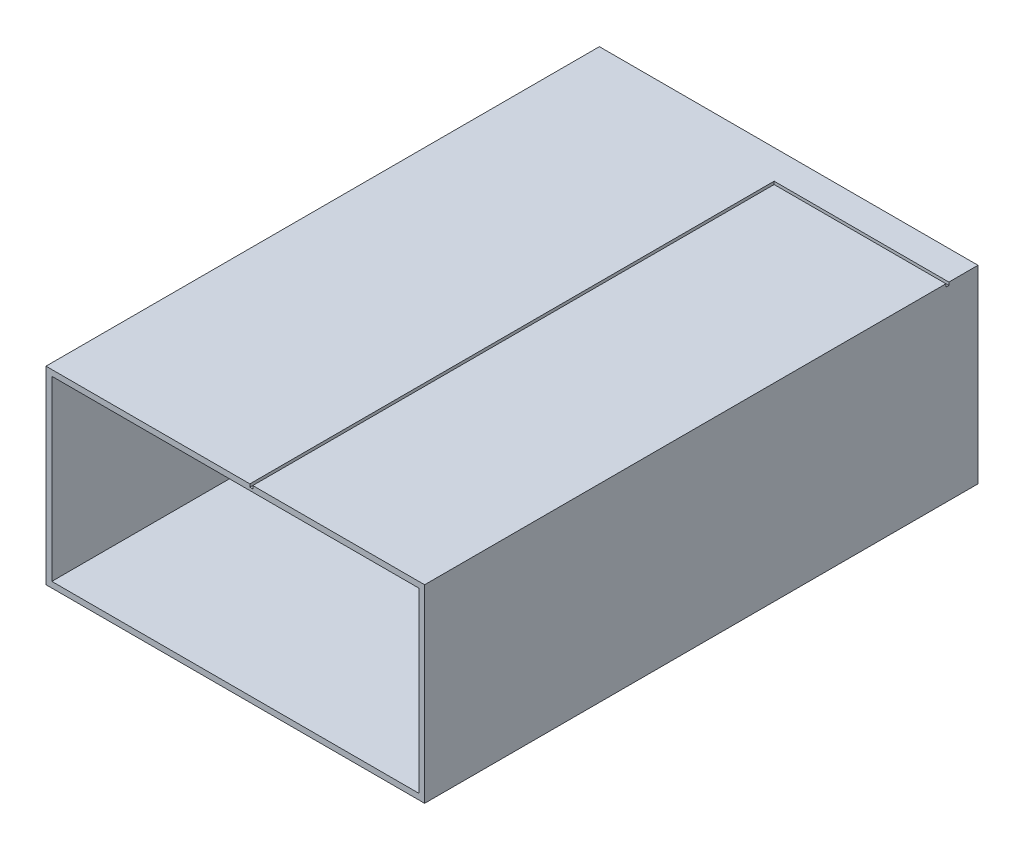
ISO-10303-21;
HEADER;
FILE_DESCRIPTION(('STEP AP214'),'2;1');
FILE_NAME('part.step','',(''),(''),'','','');
FILE_SCHEMA(('AUTOMOTIVE_DESIGN { 1 0 10303 214 1 1 1 1 }'));
ENDSEC;
DATA;
#1=APPLICATION_CONTEXT('core data for automotive mechanical design processes');
#2=APPLICATION_PROTOCOL_DEFINITION('international standard','automotive_design',2000,#1);
#3=PRODUCT_CONTEXT('',#1,'mechanical');
#4=PRODUCT('Part','Part','',(#3));
#5=PRODUCT_RELATED_PRODUCT_CATEGORY('part','',(#4));
#6=PRODUCT_DEFINITION_FORMATION('','',#4);
#7=PRODUCT_DEFINITION_CONTEXT('part definition',#1,'design');
#8=PRODUCT_DEFINITION('design','',#6,#7);
#9=PRODUCT_DEFINITION_SHAPE('','',#8);
#10=(LENGTH_UNIT() NAMED_UNIT(*) SI_UNIT(.MILLI.,.METRE.));
#11=(NAMED_UNIT(*) PLANE_ANGLE_UNIT() SI_UNIT($,.RADIAN.));
#12=(NAMED_UNIT(*) SI_UNIT($,.STERADIAN.) SOLID_ANGLE_UNIT());
#13=UNCERTAINTY_MEASURE_WITH_UNIT(LENGTH_MEASURE(1.E-05),#10,'distance_accuracy_value','');
#14=(GEOMETRIC_REPRESENTATION_CONTEXT(3) GLOBAL_UNCERTAINTY_ASSIGNED_CONTEXT((#13)) GLOBAL_UNIT_ASSIGNED_CONTEXT((#10,
#11,#12)) REPRESENTATION_CONTEXT('',''));
#15=CARTESIAN_POINT('',(0.,0.,0.));
#16=DIRECTION('',(0.,0.,1.));
#17=DIRECTION('',(1.,0.,0.));
#18=AXIS2_PLACEMENT_3D('',#15,#16,#17);
#19=CARTESIAN_POINT('',(-900.,-860.,0.));
#20=DIRECTION('',(-1.,0.,0.));
#21=DIRECTION('',(0.,0.,1.));
#22=AXIS2_PLACEMENT_3D('',#19,#20,#21);
#23=PLANE('',#22);
#24=DIRECTION('',(0.,-1.,0.));
#25=VECTOR('',#24,1.);
#26=CARTESIAN_POINT('',(-900.,-1185.,2000.));
#27=LINE('',#26,#25);
#28=CARTESIAN_POINT('',(-900.,-860.,2000.));
#29=VERTEX_POINT('',#28);
#30=CARTESIAN_POINT('',(-900.,-1510.,2000.));
#31=VERTEX_POINT('',#30);
#32=EDGE_CURVE('E9',#29,#31,#27,.T.);
#33=ORIENTED_EDGE('',*,*,#32,.F.);
#34=DIRECTION('',(0.,0.,1.));
#35=VECTOR('',#34,1.);
#36=CARTESIAN_POINT('',(-900.,-860.,1050.));
#37=LINE('',#36,#35);
#38=CARTESIAN_POINT('',(-900.,-860.,100.));
#39=VERTEX_POINT('',#38);
#40=EDGE_CURVE('E26',#39,#29,#37,.T.);
#41=ORIENTED_EDGE('',*,*,#40,.F.);
#42=DIRECTION('',(0.,-1.,0.));
#43=VECTOR('',#42,1.);
#44=CARTESIAN_POINT('',(-900.,-1185.,100.));
#45=LINE('',#44,#43);
#46=CARTESIAN_POINT('',(-900.,-1510.,100.));
#47=VERTEX_POINT('',#46);
#48=EDGE_CURVE('E259',#39,#47,#45,.T.);
#49=ORIENTED_EDGE('',*,*,#48,.T.);
#50=DIRECTION('',(0.,0.,1.));
#51=VECTOR('',#50,1.);
#52=CARTESIAN_POINT('',(-900.,-1510.,1050.));
#53=LINE('',#52,#51);
#54=EDGE_CURVE('E35',#47,#31,#53,.T.);
#55=ORIENTED_EDGE('',*,*,#54,.T.);
#56=EDGE_LOOP('',(#33,#41,#49,#55));
#57=FACE_BOUND('',#56,.T.);
#58=ADVANCED_FACE('F15',(#57),#23,.T.);
#59=CARTESIAN_POINT('',(-900.,-1510.,0.));
#60=DIRECTION('',(0.,-1.,0.));
#61=DIRECTION('',(0.,0.,-1.));
#62=AXIS2_PLACEMENT_3D('',#59,#60,#61);
#63=PLANE('',#62);
#64=DIRECTION('',(1.,0.,0.));
#65=VECTOR('',#64,1.);
#66=CARTESIAN_POINT('',(-250.,-1510.,2000.));
#67=LINE('',#66,#65);
#68=CARTESIAN_POINT('',(400.,-1510.,2000.));
#69=VERTEX_POINT('',#68);
#70=EDGE_CURVE('E268',#31,#69,#67,.T.);
#71=ORIENTED_EDGE('',*,*,#70,.F.);
#72=ORIENTED_EDGE('',*,*,#54,.F.);
#73=DIRECTION('',(1.,0.,0.));
#74=VECTOR('',#73,1.);
#75=CARTESIAN_POINT('',(-250.,-1510.,100.));
#76=LINE('',#75,#74);
#77=CARTESIAN_POINT('',(400.,-1510.,100.));
#78=VERTEX_POINT('',#77);
#79=EDGE_CURVE('E253',#47,#78,#76,.T.);
#80=ORIENTED_EDGE('',*,*,#79,.T.);
#81=DIRECTION('',(0.,0.,1.));
#82=VECTOR('',#81,1.);
#83=CARTESIAN_POINT('',(400.,-1510.,1050.));
#84=LINE('',#83,#82);
#85=EDGE_CURVE('E158',#78,#69,#84,.T.);
#86=ORIENTED_EDGE('',*,*,#85,.T.);
#87=EDGE_LOOP('',(#71,#72,#80,#86));
#88=FACE_BOUND('',#87,.T.);
#89=ADVANCED_FACE('F287',(#88),#63,.T.);
#90=CARTESIAN_POINT('',(0.,0.,100.));
#91=DIRECTION('',(0.,0.,1.));
#92=DIRECTION('',(1.,0.,0.));
#93=AXIS2_PLACEMENT_3D('',#90,#91,#92);
#94=PLANE('',#93);
#95=DIRECTION('',(0.,1.,0.));
#96=VECTOR('',#95,1.);
#97=CARTESIAN_POINT('',(400.,-1185.,100.));
#98=LINE('',#97,#96);
#99=CARTESIAN_POINT('',(400.,-860.,100.));
#100=VERTEX_POINT('',#99);
#101=EDGE_CURVE('E258',#78,#100,#98,.T.);
#102=ORIENTED_EDGE('',*,*,#101,.F.);
#103=ORIENTED_EDGE('',*,*,#79,.F.);
#104=ORIENTED_EDGE('',*,*,#48,.F.);
#105=DIRECTION('',(-1.,0.,0.));
#106=VECTOR('',#105,1.);
#107=CARTESIAN_POINT('',(-250.000000000001,-860.,100.));
#108=LINE('',#107,#106);
#109=EDGE_CURVE('E254',#100,#39,#108,.T.);
#110=ORIENTED_EDGE('',*,*,#109,.F.);
#111=EDGE_LOOP('',(#102,#103,#104,#110));
#112=FACE_BOUND('',#111,.T.);
#113=ADVANCED_FACE('F289',(#112),#94,.F.);
#114=CARTESIAN_POINT('',(-880.,-880.,2000.));
#115=DIRECTION('',(0.,1.,0.));
#116=DIRECTION('',(0.,0.,1.));
#117=AXIS2_PLACEMENT_3D('',#114,#115,#116);
#118=PLANE('',#117);
#119=DIRECTION('',(-1.,0.,0.));
#120=VECTOR('',#119,1.);
#121=CARTESIAN_POINT('',(-250.,-880.,200.));
#122=LINE('',#121,#120);
#123=CARTESIAN_POINT('',(379.999999999999,-880.,200.));
#124=VERTEX_POINT('',#123);
#125=CARTESIAN_POINT('',(-880.,-880.,200.));
#126=VERTEX_POINT('',#125);
#127=EDGE_CURVE('E245',#124,#126,#122,.T.);
#128=ORIENTED_EDGE('',*,*,#127,.F.);
#129=DIRECTION('',(0.,0.,-1.));
#130=VECTOR('',#129,1.);
#131=CARTESIAN_POINT('',(380.,-880.,1100.));
#132=LINE('',#131,#130);
#133=CARTESIAN_POINT('',(379.999999999999,-880.,2000.));
#134=VERTEX_POINT('',#133);
#135=EDGE_CURVE('E242',#134,#124,#132,.T.);
#136=ORIENTED_EDGE('',*,*,#135,.F.);
#137=DIRECTION('',(-1.,0.,0.));
#138=VECTOR('',#137,1.);
#139=CARTESIAN_POINT('',(-250.,-880.,2000.));
#140=LINE('',#139,#138);
#141=CARTESIAN_POINT('',(-880.,-880.,2000.));
#142=VERTEX_POINT('',#141);
#143=EDGE_CURVE('E229',#134,#142,#140,.T.);
#144=ORIENTED_EDGE('',*,*,#143,.T.);
#145=DIRECTION('',(0.,0.,-1.));
#146=VECTOR('',#145,1.);
#147=CARTESIAN_POINT('',(-880.,-880.,1100.));
#148=LINE('',#147,#146);
#149=EDGE_CURVE('E233',#142,#126,#148,.T.);
#150=ORIENTED_EDGE('',*,*,#149,.T.);
#151=EDGE_LOOP('',(#128,#136,#144,#150));
#152=FACE_BOUND('',#151,.T.);
#153=ADVANCED_FACE('F329',(#152),#118,.F.);
#154=CARTESIAN_POINT('',(-880.,-1490.,2000.));
#155=DIRECTION('',(-1.,0.,0.));
#156=DIRECTION('',(0.,0.,1.));
#157=AXIS2_PLACEMENT_3D('',#154,#155,#156);
#158=PLANE('',#157);
#159=DIRECTION('',(0.,-1.,0.));
#160=VECTOR('',#159,1.);
#161=CARTESIAN_POINT('',(-880.,-1185.,200.));
#162=LINE('',#161,#160);
#163=CARTESIAN_POINT('',(-880.,-1490.,200.));
#164=VERTEX_POINT('',#163);
#165=EDGE_CURVE('E238',#126,#164,#162,.T.);
#166=ORIENTED_EDGE('',*,*,#165,.F.);
#167=ORIENTED_EDGE('',*,*,#149,.F.);
#168=DIRECTION('',(0.,-1.,0.));
#169=VECTOR('',#168,1.);
#170=CARTESIAN_POINT('',(-880.,-1185.,2000.));
#171=LINE('',#170,#169);
#172=CARTESIAN_POINT('',(-880.,-1490.,2000.));
#173=VERTEX_POINT('',#172);
#174=EDGE_CURVE('E217',#142,#173,#171,.T.);
#175=ORIENTED_EDGE('',*,*,#174,.T.);
#176=DIRECTION('',(0.,0.,-1.));
#177=VECTOR('',#176,1.);
#178=CARTESIAN_POINT('',(-880.,-1490.,1100.));
#179=LINE('',#178,#177);
#180=EDGE_CURVE('E212',#173,#164,#179,.T.);
#181=ORIENTED_EDGE('',*,*,#180,.T.);
#182=EDGE_LOOP('',(#166,#167,#175,#181));
#183=FACE_BOUND('',#182,.T.);
#184=ADVANCED_FACE('F322',(#183),#158,.F.);
#185=CARTESIAN_POINT('',(379.999999999999,-880.,2000.));
#186=DIRECTION('',(1.,0.,0.));
#187=DIRECTION('',(0.,0.,-1.));
#188=AXIS2_PLACEMENT_3D('',#185,#186,#187);
#189=PLANE('',#188);
#190=DIRECTION('',(0.,1.,0.));
#191=VECTOR('',#190,1.);
#192=CARTESIAN_POINT('',(379.999999999999,-1185.,200.));
#193=LINE('',#192,#191);
#194=CARTESIAN_POINT('',(379.999999999999,-1490.,200.));
#195=VERTEX_POINT('',#194);
#196=EDGE_CURVE('E225',#195,#124,#193,.T.);
#197=ORIENTED_EDGE('',*,*,#196,.F.);
#198=DIRECTION('',(0.,0.,-1.));
#199=VECTOR('',#198,1.);
#200=CARTESIAN_POINT('',(379.999999999999,-1490.,1100.));
#201=LINE('',#200,#199);
#202=CARTESIAN_POINT('',(379.999999999999,-1490.,2000.));
#203=VERTEX_POINT('',#202);
#204=EDGE_CURVE('E222',#203,#195,#201,.T.);
#205=ORIENTED_EDGE('',*,*,#204,.F.);
#206=DIRECTION('',(0.,1.,0.));
#207=VECTOR('',#206,1.);
#208=CARTESIAN_POINT('',(379.999999999999,-1185.,2000.));
#209=LINE('',#208,#207);
#210=EDGE_CURVE('E150',#203,#134,#209,.T.);
#211=ORIENTED_EDGE('',*,*,#210,.T.);
#212=ORIENTED_EDGE('',*,*,#135,.T.);
#213=EDGE_LOOP('',(#197,#205,#211,#212));
#214=FACE_BOUND('',#213,.T.);
#215=ADVANCED_FACE('F315',(#214),#189,.F.);
#216=CARTESIAN_POINT('',(379.999999999999,-1490.,2000.));
#217=DIRECTION('',(0.,-1.,0.));
#218=DIRECTION('',(0.,0.,-1.));
#219=AXIS2_PLACEMENT_3D('',#216,#217,#218);
#220=PLANE('',#219);
#221=DIRECTION('',(1.,0.,0.));
#222=VECTOR('',#221,1.);
#223=CARTESIAN_POINT('',(-250.,-1490.,200.));
#224=LINE('',#223,#222);
#225=EDGE_CURVE('E218',#164,#195,#224,.T.);
#226=ORIENTED_EDGE('',*,*,#225,.F.);
#227=ORIENTED_EDGE('',*,*,#180,.F.);
#228=DIRECTION('',(1.,0.,0.));
#229=VECTOR('',#228,1.);
#230=CARTESIAN_POINT('',(-250.,-1490.,2000.));
#231=LINE('',#230,#229);
#232=EDGE_CURVE('E213',#173,#203,#231,.T.);
#233=ORIENTED_EDGE('',*,*,#232,.T.);
#234=ORIENTED_EDGE('',*,*,#204,.T.);
#235=EDGE_LOOP('',(#226,#227,#233,#234));
#236=FACE_BOUND('',#235,.T.);
#237=ADVANCED_FACE('F319',(#236),#220,.F.);
#238=CARTESIAN_POINT('',(0.,0.,200.));
#239=DIRECTION('',(0.,0.,1.));
#240=DIRECTION('',(1.,0.,0.));
#241=AXIS2_PLACEMENT_3D('',#238,#239,#240);
#242=PLANE('',#241);
#243=ORIENTED_EDGE('',*,*,#196,.T.);
#244=ORIENTED_EDGE('',*,*,#127,.T.);
#245=ORIENTED_EDGE('',*,*,#165,.T.);
#246=ORIENTED_EDGE('',*,*,#225,.T.);
#247=EDGE_LOOP('',(#243,#244,#245,#246));
#248=FACE_BOUND('',#247,.T.);
#249=CARTESIAN_POINT('',(-250.,-1190.,200.));
#250=DIRECTION('',(0.,0.,1.));
#251=DIRECTION('',(1.,0.,0.));
#252=AXIS2_PLACEMENT_3D('',#249,#250,#251);
#253=CIRCLE('',#252,40.);
#254=CARTESIAN_POINT('',(-210.,-1190.,200.));
#255=VERTEX_POINT('',#254);
#256=EDGE_CURVE('E208',#255,#255,#253,.T.);
#257=ORIENTED_EDGE('',*,*,#256,.F.);
#258=EDGE_LOOP('',(#257));
#259=FACE_BOUND('',#258,.T.);
#260=ADVANCED_FACE('F325',(#248,#259),#242,.T.);
#261=CARTESIAN_POINT('',(-250.,-1190.,190.));
#262=DIRECTION('',(0.,0.,1.));
#263=DIRECTION('',(1.,0.,0.));
#264=AXIS2_PLACEMENT_3D('',#261,#262,#263);
#265=CYLINDRICAL_SURFACE('',#264,40.);
#266=CARTESIAN_POINT('',(-250.,-1190.,180.));
#267=DIRECTION('',(0.,0.,1.));
#268=DIRECTION('',(1.,0.,0.));
#269=AXIS2_PLACEMENT_3D('',#266,#267,#268);
#270=CIRCLE('',#269,40.);
#271=CARTESIAN_POINT('',(-210.,-1190.,180.));
#272=VERTEX_POINT('',#271);
#273=EDGE_CURVE('E204',#272,#272,#270,.T.);
#274=ORIENTED_EDGE('',*,*,#273,.F.);
#275=EDGE_LOOP('',(#274));
#276=FACE_BOUND('',#275,.T.);
#277=ORIENTED_EDGE('',*,*,#256,.T.);
#278=EDGE_LOOP('',(#277));
#279=FACE_BOUND('',#278,.T.);
#280=ADVANCED_FACE('F388',(#276,#279),#265,.F.);
#281=CARTESIAN_POINT('',(0.,0.,180.));
#282=DIRECTION('',(0.,0.,1.));
#283=DIRECTION('',(1.,0.,0.));
#284=AXIS2_PLACEMENT_3D('',#281,#282,#283);
#285=PLANE('',#284);
#286=ORIENTED_EDGE('',*,*,#273,.T.);
#287=EDGE_LOOP('',(#286));
#288=FACE_BOUND('',#287,.T.);
#289=ADVANCED_FACE('F397',(#288),#285,.T.);
#290=CARTESIAN_POINT('',(-190.,-860.,2000.));
#291=DIRECTION('',(-1.,0.,0.));
#292=DIRECTION('',(0.,0.,1.));
#293=AXIS2_PLACEMENT_3D('',#290,#291,#292);
#294=PLANE('',#293);
#295=DIRECTION('',(0.,1.,0.));
#296=VECTOR('',#295,1.);
#297=CARTESIAN_POINT('',(-190.,-865.,210.));
#298=LINE('',#297,#296);
#299=CARTESIAN_POINT('',(-190.,-870.,210.));
#300=VERTEX_POINT('',#299);
#301=CARTESIAN_POINT('',(-190.,-860.,210.));
#302=VERTEX_POINT('',#301);
#303=EDGE_CURVE('E198',#300,#302,#298,.T.);
#304=ORIENTED_EDGE('',*,*,#303,.F.);
#305=DIRECTION('',(0.,0.,-1.));
#306=VECTOR('',#305,1.);
#307=CARTESIAN_POINT('',(-190.,-870.,1105.));
#308=LINE('',#307,#306);
#309=CARTESIAN_POINT('',(-190.,-870.,2000.));
#310=VERTEX_POINT('',#309);
#311=EDGE_CURVE('E192',#310,#300,#308,.T.);
#312=ORIENTED_EDGE('',*,*,#311,.F.);
#313=DIRECTION('',(0.,-1.,0.));
#314=VECTOR('',#313,1.);
#315=CARTESIAN_POINT('',(-190.,-865.,2000.));
#316=LINE('',#315,#314);
#317=CARTESIAN_POINT('',(-190.,-860.,2000.));
#318=VERTEX_POINT('',#317);
#319=EDGE_CURVE('E195',#318,#310,#316,.T.);
#320=ORIENTED_EDGE('',*,*,#319,.F.);
#321=DIRECTION('',(0.,0.,-1.));
#322=VECTOR('',#321,1.);
#323=CARTESIAN_POINT('',(-190.,-860.,1105.));
#324=LINE('',#323,#322);
#325=EDGE_CURVE('E167',#318,#302,#324,.T.);
#326=ORIENTED_EDGE('',*,*,#325,.T.);
#327=EDGE_LOOP('',(#304,#312,#320,#326));
#328=FACE_BOUND('',#327,.T.);
#329=ADVANCED_FACE('F304',(#328),#294,.T.);
#330=CARTESIAN_POINT('',(399.999999999999,-860.,0.));
#331=DIRECTION('',(0.,1.,0.));
#332=DIRECTION('',(0.,0.,1.));
#333=AXIS2_PLACEMENT_3D('',#330,#331,#332);
#334=PLANE('',#333);
#335=DIRECTION('',(-1.,0.,0.));
#336=VECTOR('',#335,1.);
#337=CARTESIAN_POINT('',(99.9999999999997,-860.,200.));
#338=LINE('',#337,#336);
#339=CARTESIAN_POINT('',(400.,-860.,200.));
#340=VERTEX_POINT('',#339);
#341=CARTESIAN_POINT('',(-200.,-860.,200.));
#342=VERTEX_POINT('',#341);
#343=EDGE_CURVE('E143',#340,#342,#338,.T.);
#344=ORIENTED_EDGE('',*,*,#343,.F.);
#345=DIRECTION('',(0.,0.,1.));
#346=VECTOR('',#345,1.);
#347=CARTESIAN_POINT('',(399.999999999999,-860.,150.));
#348=LINE('',#347,#346);
#349=EDGE_CURVE('E180',#100,#340,#348,.T.);
#350=ORIENTED_EDGE('',*,*,#349,.F.);
#351=ORIENTED_EDGE('',*,*,#109,.T.);
#352=ORIENTED_EDGE('',*,*,#40,.T.);
#353=DIRECTION('',(-1.,0.,0.));
#354=VECTOR('',#353,1.);
#355=CARTESIAN_POINT('',(-550.,-860.,2000.));
#356=LINE('',#355,#354);
#357=CARTESIAN_POINT('',(-200.,-860.,2000.));
#358=VERTEX_POINT('',#357);
#359=EDGE_CURVE('E183',#358,#29,#356,.T.);
#360=ORIENTED_EDGE('',*,*,#359,.F.);
#361=DIRECTION('',(0.,0.,1.));
#362=VECTOR('',#361,1.);
#363=CARTESIAN_POINT('',(-200.,-860.,1100.));
#364=LINE('',#363,#362);
#365=EDGE_CURVE('E187',#342,#358,#364,.T.);
#366=ORIENTED_EDGE('',*,*,#365,.F.);
#367=EDGE_LOOP('',(#344,#350,#351,#352,#360,#366));
#368=FACE_BOUND('',#367,.T.);
#369=ADVANCED_FACE('F296',(#368),#334,.T.);
#370=CARTESIAN_POINT('',(399.999999999999,-860.,0.));
#371=DIRECTION('',(0.,1.,0.));
#372=DIRECTION('',(0.,0.,1.));
#373=AXIS2_PLACEMENT_3D('',#370,#371,#372);
#374=PLANE('',#373);
#375=DIRECTION('',(1.,0.,0.));
#376=VECTOR('',#375,1.);
#377=CARTESIAN_POINT('',(105.,-860.,210.));
#378=LINE('',#377,#376);
#379=CARTESIAN_POINT('',(400.,-860.,210.));
#380=VERTEX_POINT('',#379);
#381=EDGE_CURVE('E176',#302,#380,#378,.T.);
#382=ORIENTED_EDGE('',*,*,#381,.F.);
#383=ORIENTED_EDGE('',*,*,#325,.F.);
#384=DIRECTION('',(-1.,0.,0.));
#385=VECTOR('',#384,1.);
#386=CARTESIAN_POINT('',(105.,-860.,2000.));
#387=LINE('',#386,#385);
#388=CARTESIAN_POINT('',(400.,-860.,2000.));
#389=VERTEX_POINT('',#388);
#390=EDGE_CURVE('E168',#389,#318,#387,.T.);
#391=ORIENTED_EDGE('',*,*,#390,.F.);
#392=DIRECTION('',(0.,0.,1.));
#393=VECTOR('',#392,1.);
#394=CARTESIAN_POINT('',(399.999999999999,-860.,1105.));
#395=LINE('',#394,#393);
#396=EDGE_CURVE('E172',#380,#389,#395,.T.);
#397=ORIENTED_EDGE('',*,*,#396,.F.);
#398=EDGE_LOOP('',(#382,#383,#391,#397));
#399=FACE_BOUND('',#398,.T.);
#400=ADVANCED_FACE('F306',(#399),#374,.T.);
#401=CARTESIAN_POINT('',(400.,-1510.,0.));
#402=DIRECTION('',(1.,0.,0.));
#403=DIRECTION('',(0.,0.,-1.));
#404=AXIS2_PLACEMENT_3D('',#401,#402,#403);
#405=PLANE('',#404);
#406=DIRECTION('',(0.,-1.,0.));
#407=VECTOR('',#406,1.);
#408=CARTESIAN_POINT('',(400.,-865.,210.));
#409=LINE('',#408,#407);
#410=CARTESIAN_POINT('',(400.,-870.,210.));
#411=VERTEX_POINT('',#410);
#412=EDGE_CURVE('E163',#380,#411,#409,.T.);
#413=ORIENTED_EDGE('',*,*,#412,.F.);
#414=ORIENTED_EDGE('',*,*,#396,.T.);
#415=DIRECTION('',(0.,1.,0.));
#416=VECTOR('',#415,1.);
#417=CARTESIAN_POINT('',(400.,-1185.,2000.));
#418=LINE('',#417,#416);
#419=EDGE_CURVE('E154',#69,#389,#418,.T.);
#420=ORIENTED_EDGE('',*,*,#419,.F.);
#421=ORIENTED_EDGE('',*,*,#85,.F.);
#422=ORIENTED_EDGE('',*,*,#101,.T.);
#423=ORIENTED_EDGE('',*,*,#349,.T.);
#424=DIRECTION('',(0.,-1.,0.));
#425=VECTOR('',#424,1.);
#426=CARTESIAN_POINT('',(400.,-865.,200.));
#427=LINE('',#426,#425);
#428=CARTESIAN_POINT('',(400.,-870.,200.));
#429=VERTEX_POINT('',#428);
#430=EDGE_CURVE('E138',#340,#429,#427,.T.);
#431=ORIENTED_EDGE('',*,*,#430,.T.);
#432=DIRECTION('',(0.,0.,-1.));
#433=VECTOR('',#432,1.);
#434=CARTESIAN_POINT('',(400.,-870.,205.));
#435=LINE('',#434,#433);
#436=EDGE_CURVE('E134',#411,#429,#435,.T.);
#437=ORIENTED_EDGE('',*,*,#436,.F.);
#438=EDGE_LOOP('',(#413,#414,#420,#421,#422,#423,#431,#437));
#439=FACE_BOUND('',#438,.T.);
#440=ADVANCED_FACE('F293',(#439),#405,.T.);
#441=CARTESIAN_POINT('',(-200.,-860.,210.));
#442=DIRECTION('',(0.,0.,-1.));
#443=DIRECTION('',(-1.,0.,0.));
#444=AXIS2_PLACEMENT_3D('',#441,#442,#443);
#445=PLANE('',#444);
#446=ORIENTED_EDGE('',*,*,#381,.T.);
#447=ORIENTED_EDGE('',*,*,#412,.T.);
#448=DIRECTION('',(1.,0.,0.));
#449=VECTOR('',#448,1.);
#450=CARTESIAN_POINT('',(105.,-870.,210.));
#451=LINE('',#450,#449);
#452=EDGE_CURVE('E151',#300,#411,#451,.T.);
#453=ORIENTED_EDGE('',*,*,#452,.F.);
#454=ORIENTED_EDGE('',*,*,#303,.T.);
#455=EDGE_LOOP('',(#446,#447,#453,#454));
#456=FACE_BOUND('',#455,.T.);
#457=ADVANCED_FACE('F299',(#456),#445,.T.);
#458=CARTESIAN_POINT('',(0.,-870.,0.));
#459=DIRECTION('',(0.,1.,0.));
#460=DIRECTION('',(0.,0.,1.));
#461=AXIS2_PLACEMENT_3D('',#458,#459,#460);
#462=PLANE('',#461);
#463=ORIENTED_EDGE('',*,*,#452,.T.);
#464=ORIENTED_EDGE('',*,*,#436,.T.);
#465=DIRECTION('',(-1.,0.,0.));
#466=VECTOR('',#465,1.);
#467=CARTESIAN_POINT('',(99.9999999999998,-870.,200.));
#468=LINE('',#467,#466);
#469=CARTESIAN_POINT('',(-200.,-870.,200.));
#470=VERTEX_POINT('',#469);
#471=EDGE_CURVE('E131',#429,#470,#468,.T.);
#472=ORIENTED_EDGE('',*,*,#471,.T.);
#473=DIRECTION('',(0.,0.,1.));
#474=VECTOR('',#473,1.);
#475=CARTESIAN_POINT('',(-200.,-870.,1100.));
#476=LINE('',#475,#474);
#477=CARTESIAN_POINT('',(-200.,-870.,2000.));
#478=VERTEX_POINT('',#477);
#479=EDGE_CURVE('E120',#470,#478,#476,.T.);
#480=ORIENTED_EDGE('',*,*,#479,.T.);
#481=DIRECTION('',(1.,0.,0.));
#482=VECTOR('',#481,1.);
#483=CARTESIAN_POINT('',(-195.,-870.,2000.));
#484=LINE('',#483,#482);
#485=EDGE_CURVE('E114',#478,#310,#484,.T.);
#486=ORIENTED_EDGE('',*,*,#485,.T.);
#487=ORIENTED_EDGE('',*,*,#311,.T.);
#488=EDGE_LOOP('',(#463,#464,#472,#480,#486,#487));
#489=FACE_BOUND('',#488,.T.);
#490=ADVANCED_FACE('F133',(#489),#462,.T.);
#491=CARTESIAN_POINT('',(0.,0.,200.));
#492=DIRECTION('',(0.,0.,1.));
#493=DIRECTION('',(1.,0.,0.));
#494=AXIS2_PLACEMENT_3D('',#491,#492,#493);
#495=PLANE('',#494);
#496=DIRECTION('',(0.,-1.,0.));
#497=VECTOR('',#496,1.);
#498=CARTESIAN_POINT('',(-200.,-865.,200.));
#499=LINE('',#498,#497);
#500=EDGE_CURVE('E125',#342,#470,#499,.T.);
#501=ORIENTED_EDGE('',*,*,#500,.T.);
#502=ORIENTED_EDGE('',*,*,#471,.F.);
#503=ORIENTED_EDGE('',*,*,#430,.F.);
#504=ORIENTED_EDGE('',*,*,#343,.T.);
#505=EDGE_LOOP('',(#501,#502,#503,#504));
#506=FACE_BOUND('',#505,.T.);
#507=ADVANCED_FACE('F141',(#506),#495,.T.);
#508=CARTESIAN_POINT('',(-200.,-860.,200.));
#509=DIRECTION('',(1.,0.,0.));
#510=DIRECTION('',(0.,0.,-1.));
#511=AXIS2_PLACEMENT_3D('',#508,#509,#510);
#512=PLANE('',#511);
#513=ORIENTED_EDGE('',*,*,#500,.F.);
#514=ORIENTED_EDGE('',*,*,#365,.T.);
#515=DIRECTION('',(0.,-1.,0.));
#516=VECTOR('',#515,1.);
#517=CARTESIAN_POINT('',(-200.,-865.,2000.));
#518=LINE('',#517,#516);
#519=EDGE_CURVE('E19',#358,#478,#518,.T.);
#520=ORIENTED_EDGE('',*,*,#519,.T.);
#521=ORIENTED_EDGE('',*,*,#479,.F.);
#522=EDGE_LOOP('',(#513,#514,#520,#521));
#523=FACE_BOUND('',#522,.T.);
#524=ADVANCED_FACE('F122',(#523),#512,.T.);
#525=CARTESIAN_POINT('',(0.,0.,2000.));
#526=DIRECTION('',(0.,0.,1.));
#527=DIRECTION('',(1.,0.,0.));
#528=AXIS2_PLACEMENT_3D('',#525,#526,#527);
#529=PLANE('',#528);
#530=ORIENTED_EDGE('',*,*,#519,.F.);
#531=ORIENTED_EDGE('',*,*,#359,.T.);
#532=ORIENTED_EDGE('',*,*,#32,.T.);
#533=ORIENTED_EDGE('',*,*,#70,.T.);
#534=ORIENTED_EDGE('',*,*,#419,.T.);
#535=ORIENTED_EDGE('',*,*,#390,.T.);
#536=ORIENTED_EDGE('',*,*,#319,.T.);
#537=ORIENTED_EDGE('',*,*,#485,.F.);
#538=EDGE_LOOP('',(#530,#531,#532,#533,#534,#535,#536,#537));
#539=FACE_BOUND('',#538,.T.);
#540=ORIENTED_EDGE('',*,*,#210,.F.);
#541=ORIENTED_EDGE('',*,*,#232,.F.);
#542=ORIENTED_EDGE('',*,*,#174,.F.);
#543=ORIENTED_EDGE('',*,*,#143,.F.);
#544=EDGE_LOOP('',(#540,#541,#542,#543));
#545=FACE_BOUND('',#544,.T.);
#546=ADVANCED_FACE('F17',(#539,#545),#529,.T.);
#547=CLOSED_SHELL('',(#58,#89,#113,#153,#184,#215,#237,#260,#280,#289,#329,#369,#400,#440,#457,
#490,#507,#524,#546));
#548=MANIFOLD_SOLID_BREP('B1',#547);
#549=ADVANCED_BREP_SHAPE_REPRESENTATION('',(#18,#548),#14);
#550=SHAPE_DEFINITION_REPRESENTATION(#9,#549);
ENDSEC;
END-ISO-10303-21;
